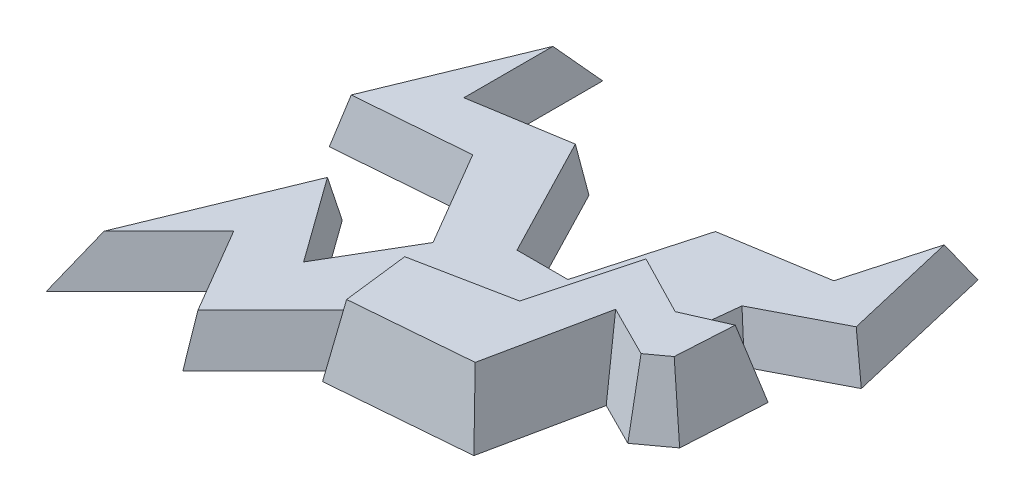
ISO-10303-21;
HEADER;
FILE_DESCRIPTION(('STEP AP214'),'2;1');
FILE_NAME('part.step','',(''),(''),'','','');
FILE_SCHEMA(('AUTOMOTIVE_DESIGN { 1 0 10303 214 1 1 1 1 }'));
ENDSEC;
DATA;
#1=APPLICATION_CONTEXT('core data for automotive mechanical design processes');
#2=APPLICATION_PROTOCOL_DEFINITION('international standard','automotive_design',2000,#1);
#3=PRODUCT_CONTEXT('',#1,'mechanical');
#4=PRODUCT('Part','Part','',(#3));
#5=PRODUCT_RELATED_PRODUCT_CATEGORY('part','',(#4));
#6=PRODUCT_DEFINITION_FORMATION('','',#4);
#7=PRODUCT_DEFINITION_CONTEXT('part definition',#1,'design');
#8=PRODUCT_DEFINITION('design','',#6,#7);
#9=PRODUCT_DEFINITION_SHAPE('','',#8);
#10=(LENGTH_UNIT() NAMED_UNIT(*) SI_UNIT(.MILLI.,.METRE.));
#11=(NAMED_UNIT(*) PLANE_ANGLE_UNIT() SI_UNIT($,.RADIAN.));
#12=(NAMED_UNIT(*) SI_UNIT($,.STERADIAN.) SOLID_ANGLE_UNIT());
#13=UNCERTAINTY_MEASURE_WITH_UNIT(LENGTH_MEASURE(1.E-05),#10,'distance_accuracy_value','');
#14=(GEOMETRIC_REPRESENTATION_CONTEXT(3) GLOBAL_UNCERTAINTY_ASSIGNED_CONTEXT((#13)) GLOBAL_UNIT_ASSIGNED_CONTEXT((#10,
#11,#12)) REPRESENTATION_CONTEXT('',''));
#15=CARTESIAN_POINT('',(0.,0.,0.));
#16=DIRECTION('',(0.,0.,1.));
#17=DIRECTION('',(1.,0.,0.));
#18=AXIS2_PLACEMENT_3D('',#15,#16,#17);
#19=CARTESIAN_POINT('',(-6.84757409622705,0.,-2.71792899711265));
#20=DIRECTION('',(-0.977739651608164,0.173648177666931,0.117777264640086));
#21=DIRECTION('',(-0.17486523314486,-0.984592377706223,0.));
#22=AXIS2_PLACEMENT_3D('',#19,#20,#21);
#23=PLANE('',#22);
#24=DIRECTION('',(0.122145306521807,0.92745628725644,-0.353419523121167));
#25=VECTOR('',#24,1.);
#26=CARTESIAN_POINT('',(-6.34440731271561,0.976717897552328,0.019108864920668));
#27=LINE('',#26,#25);
#28=CARTESIAN_POINT('',(-6.47304033684959,0.,0.391300178214777));
#29=VERTEX_POINT('',#28);
#30=CARTESIAN_POINT('',(-6.20964181726408,2.,-0.370826356431156));
#31=VERTEX_POINT('',#30);
#32=EDGE_CURVE('E352',#29,#31,#27,.T.);
#33=ORIENTED_EDGE('',*,*,#32,.F.);
#34=DIRECTION('',(0.119594168790653,0.,0.992822861738826));
#35=VECTOR('',#34,1.);
#36=CARTESIAN_POINT('',(-6.84757409622705,0.,-2.71792899711265));
#37=LINE('',#36,#35);
#38=CARTESIAN_POINT('',(-6.38636652485047,0.,1.11083143075774));
#39=VERTEX_POINT('',#38);
#40=EDGE_CURVE('E401',#29,#39,#37,.T.);
#41=ORIENTED_EDGE('',*,*,#40,.T.);
#42=DIRECTION('',(-0.150311999552599,-0.971316400591025,0.184257300353054));
#43=VECTOR('',#42,1.);
#44=CARTESIAN_POINT('',(-6.38636652485047,0.,1.11083143075774));
#45=LINE('',#44,#43);
#46=CARTESIAN_POINT('',(-5.92211409548409,3.,0.541735819149813));
#47=VERTEX_POINT('',#46);
#48=EDGE_CURVE('E41',#47,#39,#45,.T.);
#49=ORIENTED_EDGE('',*,*,#48,.F.);
#50=DIRECTION('',(-0.119594168790654,0.,-0.992822861738827));
#51=VECTOR('',#50,1.);
#52=CARTESIAN_POINT('',(-6.32238972346081,3.,-2.78119203319223));
#53=LINE('',#52,#51);
#54=CARTESIAN_POINT('',(-6.26379122764096,3.,-2.29473080434004));
#55=VERTEX_POINT('',#54);
#56=EDGE_CURVE('E415',#55,#47,#53,.F.);
#57=ORIENTED_EDGE('',*,*,#56,.F.);
#58=DIRECTION('',(-0.189206116780364,-0.972310735523728,-0.137160048695684));
#59=VECTOR('',#58,1.);
#60=CARTESIAN_POINT('',(-6.84757409622705,0.,-2.71792899711265));
#61=LINE('',#60,#59);
#62=CARTESIAN_POINT('',(-6.45838551716966,2.,-2.43579686859757));
#63=VERTEX_POINT('',#62);
#64=EDGE_CURVE('E419',#55,#63,#61,.T.);
#65=ORIENTED_EDGE('',*,*,#64,.T.);
#66=DIRECTION('',(-0.119594168790654,0.,-0.992822861738827));
#67=VECTOR('',#66,1.);
#68=CARTESIAN_POINT('',(-6.49745118104956,2.,-2.76010435449904));
#69=LINE('',#68,#67);
#70=EDGE_CURVE('E48',#63,#31,#69,.F.);
#71=ORIENTED_EDGE('',*,*,#70,.T.);
#72=EDGE_LOOP('',(#33,#41,#49,#57,#65,#71));
#73=FACE_BOUND('',#72,.T.);
#74=ADVANCED_FACE('F33',(#73),#23,.T.);
#75=CARTESIAN_POINT('',(3.95018334343433,0.,-7.6734766822284));
#76=DIRECTION('',(-0.395695699109095,0.173648177666931,-0.9018155155571));
#77=DIRECTION('',(-0.915727473508143,0.,0.401799943084109));
#78=AXIS2_PLACEMENT_3D('',#75,#76,#77);
#79=PLANE('',#78);
#80=DIRECTION('',(0.196110610489851,-0.943335432096796,-0.267691783594583));
#81=VECTOR('',#80,1.);
#82=CARTESIAN_POINT('',(2.07084899192303,-0.592330667024033,-6.96292406018774));
#83=LINE('',#82,#81);
#84=CARTESIAN_POINT('',(1.58859320004922,1.72742640615075,-6.30464293632067));
#85=VERTEX_POINT('',#84);
#86=CARTESIAN_POINT('',(1.94770898809242,0.,-6.79483745245693));
#87=VERTEX_POINT('',#86);
#88=EDGE_CURVE('E244',#85,#87,#83,.T.);
#89=ORIENTED_EDGE('',*,*,#88,.F.);
#90=DIRECTION('',(0.00596409304079609,-0.98145497975862,-0.191599979909203));
#91=VECTOR('',#90,1.);
#92=CARTESIAN_POINT('',(1.60035286775977,-0.2077520620373,-6.68242914482995));
#93=LINE('',#92,#91);
#94=CARTESIAN_POINT('',(1.58086004114586,3.,-6.05621068008569));
#95=VERTEX_POINT('',#94);
#96=EDGE_CURVE('E428',#95,#85,#93,.T.);
#97=ORIENTED_EDGE('',*,*,#96,.F.);
#98=DIRECTION('',(0.915727473508143,0.,-0.401799943084109));
#99=VECTOR('',#98,1.);
#100=CARTESIAN_POINT('',(4.16272785587289,3.,-7.18907430056195));
#101=LINE('',#100,#99);
#102=CARTESIAN_POINT('',(3.37208703292243,3.,-6.84215947398757));
#103=VERTEX_POINT('',#102);
#104=EDGE_CURVE('E456',#103,#95,#101,.F.);
#105=ORIENTED_EDGE('',*,*,#104,.F.);
#106=DIRECTION('',(0.182579436844118,-0.947486258902665,-0.262553877199169));
#107=VECTOR('',#106,1.);
#108=CARTESIAN_POINT('',(3.95018334343433,0.,-7.6734766822284));
#109=LINE('',#108,#107);
#110=CARTESIAN_POINT('',(3.95018334343433,0.,-7.6734766822284));
#111=VERTEX_POINT('',#110);
#112=EDGE_CURVE('E430',#103,#111,#109,.T.);
#113=ORIENTED_EDGE('',*,*,#112,.T.);
#114=DIRECTION('',(-0.915727473508143,0.,0.401799943084109));
#115=VECTOR('',#114,1.);
#116=CARTESIAN_POINT('',(3.95018334343433,0.,-7.6734766822284));
#117=LINE('',#116,#115);
#118=EDGE_CURVE('E413',#111,#87,#117,.T.);
#119=ORIENTED_EDGE('',*,*,#118,.T.);
#120=EDGE_LOOP('',(#89,#97,#105,#113,#119));
#121=FACE_BOUND('',#120,.T.);
#122=ADVANCED_FACE('F498',(#121),#79,.T.);
#123=CARTESIAN_POINT('',(1.59909040269213,0.,-6.64187171557096));
#124=DIRECTION('',(0.451018415672112,0.173648177666931,-0.875459136178024));
#125=DIRECTION('',(-0.888964504493672,0.,-0.45797610172401));
#126=AXIS2_PLACEMENT_3D('',#123,#124,#125);
#127=PLANE('',#126);
#128=DIRECTION('',(0.184095479758447,-0.97789730850518,-0.0991247111008756));
#129=VECTOR('',#128,1.);
#130=CARTESIAN_POINT('',(1.90608533699754,0.0409390105846478,-6.47559399059477));
#131=LINE('',#130,#129);
#132=CARTESIAN_POINT('',(1.57059384160355,1.82303725005597,-6.29495132842096));
#133=VERTEX_POINT('',#132);
#134=EDGE_CURVE('E56',#133,#85,#131,.T.);
#135=ORIENTED_EDGE('',*,*,#134,.F.);
#136=DIRECTION('',(0.450935935573091,-0.890821799330091,0.0556174778924801));
#137=VECTOR('',#136,1.);
#138=CARTESIAN_POINT('',(2.300008244792,0.382082560384103,-6.20498690943485));
#139=LINE('',#138,#137);
#140=CARTESIAN_POINT('',(1.48101491204928,2.,-6.30599980280743));
#141=VERTEX_POINT('',#140);
#142=EDGE_CURVE('E394',#141,#133,#139,.T.);
#143=ORIENTED_EDGE('',*,*,#142,.F.);
#144=DIRECTION('',(0.888964504493672,0.,0.45797610172401));
#145=VECTOR('',#144,1.);
#146=CARTESIAN_POINT('',(1.43758331618487,2.,-6.32837486150223));
#147=LINE('',#146,#145);
#148=CARTESIAN_POINT('',(-1.12075471469858,2.,-7.64637763028952));
#149=VERTEX_POINT('',#148);
#150=EDGE_CURVE('E398',#141,#149,#147,.F.);
#151=ORIENTED_EDGE('',*,*,#150,.T.);
#152=DIRECTION('',(-0.109620556370867,-0.962686191268677,-0.247423989866685));
#153=VECTOR('',#152,1.);
#154=CARTESIAN_POINT('',(-1.34849363391254,0.,-8.16040596498624));
#155=LINE('',#154,#153);
#156=CARTESIAN_POINT('',(-1.0068852550916,3.,-7.38936346294115));
#157=VERTEX_POINT('',#156);
#158=EDGE_CURVE('E425',#157,#149,#155,.T.);
#159=ORIENTED_EDGE('',*,*,#158,.F.);
#160=DIRECTION('',(0.888964504493672,0.,0.45797610172401));
#161=VECTOR('',#160,1.);
#162=CARTESIAN_POINT('',(1.35682977293124,3.,-6.17162643446786));
#163=LINE('',#162,#161);
#164=EDGE_CURVE('E458',#95,#157,#163,.F.);
#165=ORIENTED_EDGE('',*,*,#164,.F.);
#166=ORIENTED_EDGE('',*,*,#96,.T.);
#167=EDGE_LOOP('',(#135,#143,#151,#159,#165,#166));
#168=FACE_BOUND('',#167,.T.);
#169=ADVANCED_FACE('F501',(#168),#127,.T.);
#170=CARTESIAN_POINT('',(-6.38636652485047,0.,1.11083143075774));
#171=DIRECTION('',(0.0810036292405644,0.173648177666931,0.981470693624018));
#172=DIRECTION('',(0.,-0.984706630160281,0.174220700602377));
#173=AXIS2_PLACEMENT_3D('',#170,#171,#172);
#174=PLANE('',#173);
#175=DIRECTION('',(0.996611461091789,0.,-0.0822532407901954));
#176=VECTOR('',#175,1.);
#177=CARTESIAN_POINT('',(-6.38636652485047,0.,1.11083143075774));
#178=LINE('',#177,#176);
#179=CARTESIAN_POINT('',(-0.387798033415265,0.,0.615752136784966));
#180=VERTEX_POINT('',#179);
#181=EDGE_CURVE('E403',#39,#180,#178,.T.);
#182=ORIENTED_EDGE('',*,*,#181,.T.);
#183=DIRECTION('',(0.142358780321208,-0.976626593005354,0.161041843941918));
#184=VECTOR('',#183,1.);
#185=CARTESIAN_POINT('',(-0.387798033415265,0.,0.615752136784966));
#186=LINE('',#185,#184);
#187=CARTESIAN_POINT('',(-0.825095506187732,3.,0.121064059186096));
#188=VERTEX_POINT('',#187);
#189=EDGE_CURVE('E418',#188,#180,#186,.T.);
#190=ORIENTED_EDGE('',*,*,#189,.F.);
#191=DIRECTION('',(-0.996611461091789,0.,0.0822532407901954));
#192=VECTOR('',#191,1.);
#193=CARTESIAN_POINT('',(-6.42987692165654,3.,0.58364296113644));
#194=LINE('',#193,#192);
#195=EDGE_CURVE('E446',#47,#188,#194,.F.);
#196=ORIENTED_EDGE('',*,*,#195,.F.);
#197=ORIENTED_EDGE('',*,*,#48,.T.);
#198=EDGE_LOOP('',(#182,#190,#196,#197));
#199=FACE_BOUND('',#198,.T.);
#200=ADVANCED_FACE('F35',(#199),#174,.T.);
#201=CARTESIAN_POINT('',(-0.387798033415265,0.,0.615752136784966));
#202=DIRECTION('',(0.964116890076162,0.173648177666931,0.200810688616974));
#203=DIRECTION('',(0.203908517172778,0.,-0.978989947151859));
#204=AXIS2_PLACEMENT_3D('',#201,#202,#203);
#205=PLANE('',#204);
#206=DIRECTION('',(0.203908517172778,0.,-0.978989947151859));
#207=VECTOR('',#206,1.);
#208=CARTESIAN_POINT('',(-0.387798033415265,0.,0.615752136784966));
#209=LINE('',#208,#207);
#210=CARTESIAN_POINT('',(0.591376610391086,0.,-4.08538612896079));
#211=VERTEX_POINT('',#210);
#212=EDGE_CURVE('E405',#180,#211,#209,.T.);
#213=ORIENTED_EDGE('',*,*,#212,.T.);
#214=DIRECTION('',(0.120856457531196,-0.960571112235542,0.250393400495267));
#215=VECTOR('',#214,1.);
#216=CARTESIAN_POINT('',(0.719338752980646,-1.01704733153848,-3.82027099426151));
#217=LINE('',#216,#215);
#218=CARTESIAN_POINT('',(0.213924729967806,3.,-4.86740027858223));
#219=VERTEX_POINT('',#218);
#220=EDGE_CURVE('E439',#219,#211,#217,.T.);
#221=ORIENTED_EDGE('',*,*,#220,.F.);
#222=DIRECTION('',(-0.203908517172778,0.,0.978989947151859));
#223=VECTOR('',#222,1.);
#224=CARTESIAN_POINT('',(-0.905665057990947,3.,0.507888417263518));
#225=LINE('',#224,#223);
#226=EDGE_CURVE('E448',#188,#219,#225,.F.);
#227=ORIENTED_EDGE('',*,*,#226,.F.);
#228=ORIENTED_EDGE('',*,*,#189,.T.);
#229=EDGE_LOOP('',(#213,#221,#227,#228));
#230=FACE_BOUND('',#229,.T.);
#231=ADVANCED_FACE('F480',(#230),#205,.T.);
#232=CARTESIAN_POINT('',(0.591376610391086,0.,-4.08538612896079));
#233=DIRECTION('',(-0.442559045273277,0.173648177666931,0.879765765326066));
#234=DIRECTION('',(0.893337570338117,0.,0.449386231901234));
#235=AXIS2_PLACEMENT_3D('',#232,#233,#234);
#236=PLANE('',#235);
#237=DIRECTION('',(0.893337570338117,0.,0.449386231901234));
#238=VECTOR('',#237,1.);
#239=CARTESIAN_POINT('',(0.591376610391086,0.,-4.08538612896079));
#240=LINE('',#239,#238);
#241=CARTESIAN_POINT('',(2.45789253246187,0.,-3.14645040650419));
#242=VERTEX_POINT('',#241);
#243=EDGE_CURVE('E407',#211,#242,#240,.T.);
#244=ORIENTED_EDGE('',*,*,#243,.T.);
#245=DIRECTION('',(0.0167052120660392,-0.979305149909187,0.201698684306996));
#246=VECTOR('',#245,1.);
#247=CARTESIAN_POINT('',(2.45789253246187,0.,-3.14645040650419));
#248=LINE('',#247,#246);
#249=CARTESIAN_POINT('',(2.40671784375247,3.,-3.76433345651888));
#250=VERTEX_POINT('',#249);
#251=EDGE_CURVE('E436',#250,#242,#248,.T.);
#252=ORIENTED_EDGE('',*,*,#251,.F.);
#253=DIRECTION('',(-0.893337570338117,0.,-0.449386231901234));
#254=VECTOR('',#253,1.);
#255=CARTESIAN_POINT('',(0.829093362720382,3.,-4.55794467855426));
#256=LINE('',#255,#254);
#257=EDGE_CURVE('E450',#219,#250,#256,.F.);
#258=ORIENTED_EDGE('',*,*,#257,.F.);
#259=ORIENTED_EDGE('',*,*,#220,.T.);
#260=EDGE_LOOP('',(#244,#252,#258,#259));
#261=FACE_BOUND('',#260,.T.);
#262=ADVANCED_FACE('F484',(#261),#236,.T.);
#263=CARTESIAN_POINT('',(2.45789253246187,0.,-3.14645040650419));
#264=DIRECTION('',(0.581265035705157,0.173648177666931,0.794969979722277));
#265=DIRECTION('',(0.807233673060271,0.,-0.590231985813734));
#266=AXIS2_PLACEMENT_3D('',#263,#264,#265);
#267=PLANE('',#266);
#268=DIRECTION('',(0.807233673060271,0.,-0.590231985813734));
#269=VECTOR('',#268,1.);
#270=CARTESIAN_POINT('',(2.45789253246187,0.,-3.14645040650419));
#271=LINE('',#270,#269);
#272=CARTESIAN_POINT('',(3.74203258285442,0.,-4.08538612896079));
#273=VERTEX_POINT('',#272);
#274=EDGE_CURVE('E409',#242,#273,#271,.T.);
#275=ORIENTED_EDGE('',*,*,#274,.T.);
#276=DIRECTION('',(0.168050186219375,-0.981520647779553,0.0915224174398881));
#277=VECTOR('',#276,1.);
#278=CARTESIAN_POINT('',(3.74203258285442,0.,-4.08538612896079));
#279=LINE('',#278,#277);
#280=CARTESIAN_POINT('',(3.22839024654836,3.,-4.36512273250632));
#281=VERTEX_POINT('',#280);
#282=EDGE_CURVE('E433',#281,#273,#279,.T.);
#283=ORIENTED_EDGE('',*,*,#282,.F.);
#284=DIRECTION('',(-0.807233673060271,0.,0.590231985813734));
#285=VECTOR('',#284,1.);
#286=CARTESIAN_POINT('',(2.14567106053358,3.,-3.57346163539495));
#287=LINE('',#286,#285);
#288=EDGE_CURVE('E452',#250,#281,#287,.F.);
#289=ORIENTED_EDGE('',*,*,#288,.F.);
#290=ORIENTED_EDGE('',*,*,#251,.T.);
#291=EDGE_LOOP('',(#275,#283,#289,#290));
#292=FACE_BOUND('',#291,.T.);
#293=ADVANCED_FACE('F489',(#292),#267,.T.);
#294=CARTESIAN_POINT('',(3.74203258285442,0.,-4.08538612896079));
#295=DIRECTION('',(0.983154816386481,0.173648177666931,0.0570343528850703));
#296=DIRECTION('',(-0.173931300175167,0.984757788910235,0.));
#297=AXIS2_PLACEMENT_3D('',#294,#295,#296);
#298=PLANE('',#297);
#299=DIRECTION('',(0.0579141997111829,0.,-0.998321564162476));
#300=VECTOR('',#299,1.);
#301=CARTESIAN_POINT('',(3.74203258285442,0.,-4.08538612896079));
#302=LINE('',#301,#300);
#303=EDGE_CURVE('E411',#273,#111,#302,.T.);
#304=ORIENTED_EDGE('',*,*,#303,.T.);
#305=ORIENTED_EDGE('',*,*,#112,.F.);
#306=DIRECTION('',(-0.0579141997111828,0.,0.998321564162476));
#307=VECTOR('',#306,1.);
#308=CARTESIAN_POINT('',(3.21393950129965,3.,-4.11602163688645));
#309=LINE('',#308,#307);
#310=EDGE_CURVE('E454',#281,#103,#309,.F.);
#311=ORIENTED_EDGE('',*,*,#310,.F.);
#312=ORIENTED_EDGE('',*,*,#282,.T.);
#313=EDGE_LOOP('',(#304,#305,#311,#312));
#314=FACE_BOUND('',#313,.T.);
#315=ADVANCED_FACE('F495',(#314),#298,.T.);
#316=CARTESIAN_POINT('',(-1.34849363391254,0.,-8.16040596498624));
#317=DIRECTION('',(-0.951463608684397,0.173648177666931,-0.25409311628263));
#318=DIRECTION('',(-0.258012912170362,0.,0.966141468498982));
#319=AXIS2_PLACEMENT_3D('',#316,#317,#318);
#320=PLANE('',#319);
#321=ORIENTED_EDGE('',*,*,#158,.T.);
#322=DIRECTION('',(0.258012912170362,0.,-0.966141468498982));
#323=VECTOR('',#322,1.);
#324=CARTESIAN_POINT('',(-1.0077800177572,2.,-8.06941668941264));
#325=LINE('',#324,#323);
#326=CARTESIAN_POINT('',(-2.290826725436,2.,-3.26498802775292));
#327=VERTEX_POINT('',#326);
#328=EDGE_CURVE('E396',#149,#327,#325,.F.);
#329=ORIENTED_EDGE('',*,*,#328,.T.);
#330=DIRECTION('',(-0.139073846981094,-0.979106170351458,-0.148356234333382));
#331=VECTOR('',#330,1.);
#332=CARTESIAN_POINT('',(-2.6459412551288,-0.500073412443538,-3.64380443016001));
#333=LINE('',#332,#331);
#334=CARTESIAN_POINT('',(-2.14878508460846,3.,-3.11346591623346));
#335=VERTEX_POINT('',#334);
#336=EDGE_CURVE('E421',#335,#327,#333,.T.);
#337=ORIENTED_EDGE('',*,*,#336,.F.);
#338=DIRECTION('',(0.258012912170362,0.,-0.966141468498982));
#339=VECTOR('',#338,1.);
#340=CARTESIAN_POINT('',(-0.837423209679535,3.,-8.02392205162584));
#341=LINE('',#340,#339);
#342=EDGE_CURVE('E460',#157,#335,#341,.F.);
#343=ORIENTED_EDGE('',*,*,#342,.F.);
#344=EDGE_LOOP('',(#321,#329,#337,#343));
#345=FACE_BOUND('',#344,.T.);
#346=ADVANCED_FACE('F505',(#345),#320,.T.);
#347=CARTESIAN_POINT('',(-2.57491000709109,0.,-3.56803225079183));
#348=DIRECTION('',(-0.192173763358184,0.173648177666931,-0.965875538084337));
#349=DIRECTION('',(-0.980775725140299,0.,0.195138353420133));
#350=AXIS2_PLACEMENT_3D('',#347,#348,#349);
#351=PLANE('',#350);
#352=ORIENTED_EDGE('',*,*,#336,.T.);
#353=DIRECTION('',(0.980775725140299,0.,-0.195138353420133));
#354=VECTOR('',#353,1.);
#355=CARTESIAN_POINT('',(-2.5060936937331,2.,-3.22215780605954));
#356=LINE('',#355,#354);
#357=EDGE_CURVE('E11',#327,#63,#356,.F.);
#358=ORIENTED_EDGE('',*,*,#357,.T.);
#359=ORIENTED_EDGE('',*,*,#64,.F.);
#360=DIRECTION('',(0.980775725140299,0.,-0.195138353420133));
#361=VECTOR('',#360,1.);
#362=CARTESIAN_POINT('',(-2.47168553705411,3.,-3.0492205836934));
#363=LINE('',#362,#361);
#364=EDGE_CURVE('E422',#335,#55,#363,.F.);
#365=ORIENTED_EDGE('',*,*,#364,.F.);
#366=EDGE_LOOP('',(#352,#358,#359,#365));
#367=FACE_BOUND('',#366,.T.);
#368=ADVANCED_FACE('F470',(#367),#351,.T.);
#369=CARTESIAN_POINT('',(0.,3.,0.));
#370=DIRECTION('',(0.,1.,0.));
#371=DIRECTION('',(0.,0.,1.));
#372=AXIS2_PLACEMENT_3D('',#369,#370,#371);
#373=PLANE('',#372);
#374=ORIENTED_EDGE('',*,*,#56,.T.);
#375=ORIENTED_EDGE('',*,*,#195,.T.);
#376=ORIENTED_EDGE('',*,*,#226,.T.);
#377=ORIENTED_EDGE('',*,*,#257,.T.);
#378=ORIENTED_EDGE('',*,*,#288,.T.);
#379=ORIENTED_EDGE('',*,*,#310,.T.);
#380=ORIENTED_EDGE('',*,*,#104,.T.);
#381=ORIENTED_EDGE('',*,*,#164,.T.);
#382=ORIENTED_EDGE('',*,*,#342,.T.);
#383=ORIENTED_EDGE('',*,*,#364,.T.);
#384=EDGE_LOOP('',(#374,#375,#376,#377,#378,#379,#380,#381,#382,#383));
#385=FACE_BOUND('',#384,.T.);
#386=ADVANCED_FACE('F464',(#385),#373,.T.);
#387=CARTESIAN_POINT('',(0.,0.,0.));
#388=DIRECTION('',(0.,1.,0.));
#389=DIRECTION('',(0.,0.,1.));
#390=AXIS2_PLACEMENT_3D('',#387,#388,#389);
#391=PLANE('',#390);
#392=ORIENTED_EDGE('',*,*,#40,.F.);
#393=DIRECTION('',(0.707106781186541,0.,-0.707106781186554));
#394=VECTOR('',#393,1.);
#395=CARTESIAN_POINT('',(-5.40108762142211,0.,-0.680652537212723));
#396=LINE('',#395,#394);
#397=CARTESIAN_POINT('',(-9.78574087941727,0.,3.70400072078251));
#398=VERTEX_POINT('',#397);
#399=EDGE_CURVE('E296',#398,#29,#396,.T.);
#400=ORIENTED_EDGE('',*,*,#399,.F.);
#401=DIRECTION('',(0.505550363285331,0.,0.862797096762657));
#402=VECTOR('',#401,1.);
#403=CARTESIAN_POINT('',(-9.78574087941727,0.,3.70400072078251));
#404=LINE('',#403,#402);
#405=CARTESIAN_POINT('',(-11.956076079926,0.,0.));
#406=VERTEX_POINT('',#405);
#407=EDGE_CURVE('E294',#406,#398,#404,.T.);
#408=ORIENTED_EDGE('',*,*,#407,.F.);
#409=DIRECTION('',(0.707106781186541,0.,-0.707106781186554));
#410=VECTOR('',#409,1.);
#411=CARTESIAN_POINT('',(-11.956076079926,0.,0.));
#412=LINE('',#411,#410);
#413=CARTESIAN_POINT('',(-15.6600768007084,0.,3.70400072078251));
#414=VERTEX_POINT('',#413);
#415=EDGE_CURVE('E292',#414,#406,#412,.T.);
#416=ORIENTED_EDGE('',*,*,#415,.F.);
#417=DIRECTION('',(-0.380250240644345,0.,0.924883643757374));
#418=VECTOR('',#417,1.);
#419=CARTESIAN_POINT('',(-15.6600768007084,0.,3.70400072078251));
#420=LINE('',#419,#418);
#421=CARTESIAN_POINT('',(-11.956076079926,0.,-5.30524981200386));
#422=VERTEX_POINT('',#421);
#423=EDGE_CURVE('E290',#422,#414,#420,.T.);
#424=ORIENTED_EDGE('',*,*,#423,.F.);
#425=DIRECTION('',(-0.58457001511121,0.,-0.811343267324552));
#426=VECTOR('',#425,1.);
#427=CARTESIAN_POINT('',(-11.956076079926,0.,-5.30524981200386));
#428=LINE('',#427,#426);
#429=CARTESIAN_POINT('',(-9.26834297739492,0.,-1.57485978047093));
#430=VERTEX_POINT('',#429);
#431=EDGE_CURVE('E288',#430,#422,#428,.T.);
#432=ORIENTED_EDGE('',*,*,#431,.F.);
#433=DIRECTION('',(-0.506079371918981,0.,0.862486909650279));
#434=VECTOR('',#433,1.);
#435=CARTESIAN_POINT('',(-9.26834297739492,0.,-1.57485978047093));
#436=LINE('',#435,#434);
#437=CARTESIAN_POINT('',(-7.59341425041969,0.,-4.42936083657131));
#438=VERTEX_POINT('',#437);
#439=EDGE_CURVE('E286',#438,#430,#436,.T.);
#440=ORIENTED_EDGE('',*,*,#439,.F.);
#441=DIRECTION('',(0.505550363285331,0.,0.862797096762657));
#442=VECTOR('',#441,1.);
#443=CARTESIAN_POINT('',(-7.59341425041969,0.,-4.42936083657131));
#444=LINE('',#443,#442);
#445=CARTESIAN_POINT('',(-9.78574087941727,0.,-8.17089321004721));
#446=VERTEX_POINT('',#445);
#447=EDGE_CURVE('E284',#446,#438,#444,.T.);
#448=ORIENTED_EDGE('',*,*,#447,.F.);
#449=DIRECTION('',(0.996896614776686,0.,-0.0787219121133614));
#450=VECTOR('',#449,1.);
#451=CARTESIAN_POINT('',(-9.78574087941727,0.,-8.17089321004721));
#452=LINE('',#451,#450);
#453=CARTESIAN_POINT('',(-14.9679567921766,0.,-7.76166928492827));
#454=VERTEX_POINT('',#453);
#455=EDGE_CURVE('E282',#454,#446,#452,.T.);
#456=ORIENTED_EDGE('',*,*,#455,.F.);
#457=DIRECTION('',(-0.380250240644345,0.,0.924883643757375));
#458=VECTOR('',#457,1.);
#459=CARTESIAN_POINT('',(-14.9679567921766,0.,-7.76166928492827));
#460=LINE('',#459,#458);
#461=CARTESIAN_POINT('',(-11.5497747247508,0.,-16.0757223679448));
#462=VERTEX_POINT('',#461);
#463=EDGE_CURVE('E280',#462,#454,#460,.T.);
#464=ORIENTED_EDGE('',*,*,#463,.F.);
#465=DIRECTION('',(0.,0.,-1.));
#466=VECTOR('',#465,1.);
#467=CARTESIAN_POINT('',(-11.5497747247508,0.,-16.0757223679448));
#468=LINE('',#467,#466);
#469=CARTESIAN_POINT('',(-11.5497747247508,0.,-10.8860441730592));
#470=VERTEX_POINT('',#469);
#471=EDGE_CURVE('E278',#470,#462,#468,.T.);
#472=ORIENTED_EDGE('',*,*,#471,.F.);
#473=DIRECTION('',(-0.987015011420159,0.,0.160628039990732));
#474=VECTOR('',#473,1.);
#475=CARTESIAN_POINT('',(-11.5497747247508,0.,-10.8860441730592));
#476=LINE('',#475,#474);
#477=CARTESIAN_POINT('',(-7.59341425041969,0.,-11.5299071550155));
#478=VERTEX_POINT('',#477);
#479=EDGE_CURVE('E276',#478,#470,#476,.T.);
#480=ORIENTED_EDGE('',*,*,#479,.F.);
#481=DIRECTION('',(-0.459872295328065,0.,-0.887985062931633));
#482=VECTOR('',#481,1.);
#483=CARTESIAN_POINT('',(-7.59341425041969,0.,-11.5299071550155));
#484=LINE('',#483,#482);
#485=CARTESIAN_POINT('',(-4.88500045651108,0.,-6.30012702330926));
#486=VERTEX_POINT('',#485);
#487=EDGE_CURVE('E274',#486,#478,#484,.T.);
#488=ORIENTED_EDGE('',*,*,#487,.F.);
#489=DIRECTION('',(-1.,0.,0.));
#490=VECTOR('',#489,1.);
#491=CARTESIAN_POINT('',(-4.88500045651108,0.,-6.30012702330926));
#492=LINE('',#491,#490);
#493=CARTESIAN_POINT('',(-3.1839482956002,0.,-6.30012702330926));
#494=VERTEX_POINT('',#493);
#495=EDGE_CURVE('E272',#494,#486,#492,.T.);
#496=ORIENTED_EDGE('',*,*,#495,.F.);
#497=DIRECTION('',(-0.269285094003856,0.,0.963060505963844));
#498=VECTOR('',#497,1.);
#499=CARTESIAN_POINT('',(-3.1839482956002,0.,-6.30012702330926));
#500=LINE('',#499,#498);
#501=CARTESIAN_POINT('',(-1.81164564754128,0.,-11.2079756640373));
#502=VERTEX_POINT('',#501);
#503=EDGE_CURVE('E270',#502,#494,#500,.T.);
#504=ORIENTED_EDGE('',*,*,#503,.F.);
#505=DIRECTION('',(-0.987015011420159,0.,0.160628039990732));
#506=VECTOR('',#505,1.);
#507=CARTESIAN_POINT('',(-1.81164564754128,0.,-11.2079756640373));
#508=LINE('',#507,#506);
#509=CARTESIAN_POINT('',(2.55553376426917,0.,-11.9186958264365));
#510=VERTEX_POINT('',#509);
#511=EDGE_CURVE('E268',#510,#502,#508,.T.);
#512=ORIENTED_EDGE('',*,*,#511,.F.);
#513=DIRECTION('',(-0.269285094003856,0.,0.963060505963844));
#514=VECTOR('',#513,1.);
#515=CARTESIAN_POINT('',(2.55553376426917,0.,-11.9186958264365));
#516=LINE('',#515,#514);
#517=CARTESIAN_POINT('',(3.90087759887158,0.,-16.7301300383464));
#518=VERTEX_POINT('',#517);
#519=EDGE_CURVE('E264',#518,#510,#516,.T.);
#520=ORIENTED_EDGE('',*,*,#519,.F.);
#521=DIRECTION('',(-0.228251078526055,0.,-0.973602303382491));
#522=VECTOR('',#521,1.);
#523=CARTESIAN_POINT('',(3.90087759887158,0.,-16.7301300383464));
#524=LINE('',#523,#522);
#525=CARTESIAN_POINT('',(5.434208615999,0.,-10.1897245350591));
#526=VERTEX_POINT('',#525);
#527=EDGE_CURVE('E262',#526,#518,#524,.T.);
#528=ORIENTED_EDGE('',*,*,#527,.F.);
#529=DIRECTION('',(0.887985062931633,0.,-0.459872295328065));
#530=VECTOR('',#529,1.);
#531=CARTESIAN_POINT('',(5.434208615999,0.,-10.1897245350591));
#532=LINE('',#531,#530);
#533=CARTESIAN_POINT('',(2.12887895922522,0.,-8.47795076821422));
#534=VERTEX_POINT('',#533);
#535=EDGE_CURVE('E248',#534,#526,#532,.T.);
#536=ORIENTED_EDGE('',*,*,#535,.F.);
#537=DIRECTION('',(0.107021586398645,0.,-0.994256697259172));
#538=VECTOR('',#537,1.);
#539=CARTESIAN_POINT('',(2.12887895922522,0.,-8.47795076821422));
#540=LINE('',#539,#538);
#541=EDGE_CURVE('E238',#87,#534,#540,.T.);
#542=ORIENTED_EDGE('',*,*,#541,.F.);
#543=ORIENTED_EDGE('',*,*,#118,.F.);
#544=ORIENTED_EDGE('',*,*,#303,.F.);
#545=ORIENTED_EDGE('',*,*,#274,.F.);
#546=ORIENTED_EDGE('',*,*,#243,.F.);
#547=ORIENTED_EDGE('',*,*,#212,.F.);
#548=ORIENTED_EDGE('',*,*,#181,.F.);
#549=EDGE_LOOP('',(#392,#400,#408,#416,#424,#432,#440,#448,#456,#464,#472,#480,#488,#496,#504,
#512,#520,#528,#536,#542,#543,#544,#545,#546,#547,#548));
#550=FACE_BOUND('',#549,.T.);
#551=ADVANCED_FACE('F260',(#550),#391,.F.);
#552=CARTESIAN_POINT('',(0.,2.,0.));
#553=DIRECTION('',(0.,1.,0.));
#554=DIRECTION('',(0.,0.,1.));
#555=AXIS2_PLACEMENT_3D('',#552,#553,#554);
#556=PLANE('',#555);
#557=ORIENTED_EDGE('',*,*,#70,.F.);
#558=ORIENTED_EDGE('',*,*,#357,.F.);
#559=ORIENTED_EDGE('',*,*,#328,.F.);
#560=ORIENTED_EDGE('',*,*,#150,.F.);
#561=DIRECTION('',(-0.973602303382491,0.,0.228251078526055));
#562=VECTOR('',#561,1.);
#563=CARTESIAN_POINT('',(1.78531851869812,2.,-6.37734066362468));
#564=LINE('',#563,#562);
#565=CARTESIAN_POINT('',(1.54193691401137,2.,-6.32028234158687));
#566=VERTEX_POINT('',#565);
#567=EDGE_CURVE('E299',#141,#566,#564,.F.);
#568=ORIENTED_EDGE('',*,*,#567,.T.);
#569=DIRECTION('',(-0.107021586398645,0.,0.994256697259172));
#570=VECTOR('',#569,1.);
#571=CARTESIAN_POINT('',(1.77825039627145,2.,-8.51569235461482));
#572=LINE('',#571,#570);
#573=CARTESIAN_POINT('',(1.79852012521266,2.,-8.70400309107083));
#574=VERTEX_POINT('',#573);
#575=EDGE_CURVE('E354',#566,#574,#572,.F.);
#576=ORIENTED_EDGE('',*,*,#575,.T.);
#577=DIRECTION('',(-0.887985062931633,0.,0.459872295328065));
#578=VECTOR('',#577,1.);
#579=CARTESIAN_POINT('',(5.27203282930566,2.,-10.502875985181));
#580=LINE('',#579,#578);
#581=CARTESIAN_POINT('',(5.02818409512482,2.,-10.3765908912287));
#582=VERTEX_POINT('',#581);
#583=EDGE_CURVE('E254',#574,#582,#580,.F.);
#584=ORIENTED_EDGE('',*,*,#583,.T.);
#585=DIRECTION('',(0.228251078526055,0.,0.973602303382491));
#586=VECTOR('',#585,1.);
#587=CARTESIAN_POINT('',(3.55753288973909,2.,-16.6496363913065));
#588=LINE('',#587,#586);
#589=CARTESIAN_POINT('',(3.87085493789923,2.,-15.3131648628515));
#590=VERTEX_POINT('',#589);
#591=EDGE_CURVE('E357',#582,#590,#588,.F.);
#592=ORIENTED_EDGE('',*,*,#591,.T.);
#593=DIRECTION('',(0.269285094003856,0.,-0.963060505963844));
#594=VECTOR('',#593,1.);
#595=CARTESIAN_POINT('',(2.89516086678151,2.,-11.8237313712855));
#596=LINE('',#595,#594);
#597=CARTESIAN_POINT('',(2.83450453029185,2.,-11.6068024605868));
#598=VERTEX_POINT('',#597);
#599=EDGE_CURVE('E359',#590,#598,#596,.F.);
#600=ORIENTED_EDGE('',*,*,#599,.T.);
#601=DIRECTION('',(0.987015011420159,0.,-0.160628039990732));
#602=VECTOR('',#601,1.);
#603=CARTESIAN_POINT('',(-1.75499953292391,2.,-10.859900910282));
#604=LINE('',#603,#602);
#605=CARTESIAN_POINT('',(-1.53267488151861,2.,-10.8960822981876));
#606=VERTEX_POINT('',#605);
#607=EDGE_CURVE('E361',#598,#606,#604,.F.);
#608=ORIENTED_EDGE('',*,*,#607,.T.);
#609=DIRECTION('',(0.269285094003856,0.,-0.963060505963844));
#610=VECTOR('',#609,1.);
#611=CARTESIAN_POINT('',(-2.84432119308786,2.,-6.20516256815827));
#612=LINE('',#611,#610);
#613=CARTESIAN_POINT('',(-2.91637475824697,2.,-5.94747306189233));
#614=VERTEX_POINT('',#613);
#615=EDGE_CURVE('E363',#606,#614,#612,.F.);
#616=ORIENTED_EDGE('',*,*,#615,.T.);
#617=DIRECTION('',(1.,0.,0.));
#618=VECTOR('',#617,1.);
#619=CARTESIAN_POINT('',(-4.88500045651108,2.,-5.94747306189233));
#620=LINE('',#619,#618);
#621=CARTESIAN_POINT('',(-5.09950651373544,2.,-5.94747306189233));
#622=VERTEX_POINT('',#621);
#623=EDGE_CURVE('E365',#614,#622,#620,.F.);
#624=ORIENTED_EDGE('',*,*,#623,.T.);
#625=DIRECTION('',(0.459872295328065,0.,0.887985062931633));
#626=VECTOR('',#625,1.);
#627=CARTESIAN_POINT('',(-7.90656570054159,2.,-11.3677313683221));
#628=LINE('',#627,#626);
#629=CARTESIAN_POINT('',(-7.78903086966,2.,-11.1407788529013));
#630=VERTEX_POINT('',#629);
#631=EDGE_CURVE('E367',#622,#630,#628,.F.);
#632=ORIENTED_EDGE('',*,*,#631,.T.);
#633=DIRECTION('',(0.987015011420159,0.,-0.160628039990732));
#634=VECTOR('',#633,1.);
#635=CARTESIAN_POINT('',(-11.4931286101334,2.,-10.5379694193039));
#636=LINE('',#635,#634);
#637=CARTESIAN_POINT('',(-11.9024286861677,2.,-10.4713594202453));
#638=VERTEX_POINT('',#637);
#639=EDGE_CURVE('E369',#630,#638,#636,.F.);
#640=ORIENTED_EDGE('',*,*,#639,.T.);
#641=DIRECTION('',(0.,0.,1.));
#642=VECTOR('',#641,1.);
#643=CARTESIAN_POINT('',(-11.9024286861677,2.,-16.0757223679448));
#644=LINE('',#643,#642);
#645=CARTESIAN_POINT('',(-11.9024286861677,2.,-14.2905352209559));
#646=VERTEX_POINT('',#645);
#647=EDGE_CURVE('E371',#638,#646,#644,.F.);
#648=ORIENTED_EDGE('',*,*,#647,.T.);
#649=DIRECTION('',(0.380250240644345,0.,-0.924883643757375));
#650=VECTOR('',#649,1.);
#651=CARTESIAN_POINT('',(-14.6417929113558,2.,-7.62757253123531));
#652=LINE('',#651,#650);
#653=CARTESIAN_POINT('',(-14.4235474911669,2.,-8.15841143120721));
#654=VERTEX_POINT('',#653);
#655=EDGE_CURVE('E373',#646,#654,#652,.F.);
#656=ORIENTED_EDGE('',*,*,#655,.T.);
#657=DIRECTION('',(-0.996896614776686,0.,0.0787219121133614));
#658=VECTOR('',#657,1.);
#659=CARTESIAN_POINT('',(-9.81350247357436,2.,-8.52245275037134));
#660=LINE('',#659,#658);
#661=CARTESIAN_POINT('',(-9.59319520496523,2.,-8.53984974939844));
#662=VERTEX_POINT('',#661);
#663=EDGE_CURVE('E375',#654,#662,#660,.F.);
#664=ORIENTED_EDGE('',*,*,#663,.T.);
#665=DIRECTION('',(-0.505550363285331,0.,-0.862797096762657));
#666=VECTOR('',#665,1.);
#667=CARTESIAN_POINT('',(-7.28914543634731,2.,-4.60764517487965));
#668=LINE('',#667,#666);
#669=CARTESIAN_POINT('',(-7.18460743722163,2.,-4.42923548774011));
#670=VERTEX_POINT('',#669);
#671=EDGE_CURVE('E377',#662,#670,#668,.F.);
#672=ORIENTED_EDGE('',*,*,#671,.T.);
#673=DIRECTION('',(0.506079371918982,0.,-0.86248690965028));
#674=VECTOR('',#673,1.);
#675=CARTESIAN_POINT('',(-8.9641835520365,2.,-1.39638888517231));
#676=LINE('',#675,#674);
#677=CARTESIAN_POINT('',(-9.23808456350269,2.,-0.929592469357565));
#678=VERTEX_POINT('',#677);
#679=EDGE_CURVE('E379',#670,#678,#676,.F.);
#680=ORIENTED_EDGE('',*,*,#679,.T.);
#681=DIRECTION('',(0.58457001511121,0.,0.811343267324552));
#682=VECTOR('',#681,1.);
#683=CARTESIAN_POINT('',(-12.242199497217,2.,-5.09909888044934));
#684=LINE('',#683,#682);
#685=CARTESIAN_POINT('',(-11.8712238745822,2.,-4.5842100459459));
#686=VERTEX_POINT('',#685);
#687=EDGE_CURVE('E381',#678,#686,#684,.F.);
#688=ORIENTED_EDGE('',*,*,#687,.T.);
#689=DIRECTION('',(0.380250240644345,0.,-0.924883643757375));
#690=VECTOR('',#689,1.);
#691=CARTESIAN_POINT('',(-15.3339129198877,2.,3.83809747447548));
#692=LINE('',#691,#690);
#693=CARTESIAN_POINT('',(-14.6643695854329,2.,2.20956549044648));
#694=VERTEX_POINT('',#693);
#695=EDGE_CURVE('E383',#686,#694,#692,.F.);
#696=ORIENTED_EDGE('',*,*,#695,.T.);
#697=DIRECTION('',(-0.707106781186541,0.,0.707106781186554));
#698=VECTOR('',#697,1.);
#699=CARTESIAN_POINT('',(-12.2054400874562,2.,-0.249364007530209));
#700=LINE('',#699,#698);
#701=CARTESIAN_POINT('',(-11.8826138671785,2.,-0.572190227807937));
#702=VERTEX_POINT('',#701);
#703=EDGE_CURVE('E385',#694,#702,#700,.F.);
#704=ORIENTED_EDGE('',*,*,#703,.T.);
#705=DIRECTION('',(-0.505550363285331,0.,-0.862797096762657));
#706=VECTOR('',#705,1.);
#707=CARTESIAN_POINT('',(-9.48147206534489,2.,3.52571638247417));
#708=LINE('',#707,#706);
#709=CARTESIAN_POINT('',(-9.71227866666976,2.,3.13181049297458));
#710=VERTEX_POINT('',#709);
#711=EDGE_CURVE('E387',#702,#710,#708,.F.);
#712=ORIENTED_EDGE('',*,*,#711,.T.);
#713=DIRECTION('',(-0.707106781186542,0.,0.707106781186554));
#714=VECTOR('',#713,1.);
#715=CARTESIAN_POINT('',(-5.65045162895232,2.,-0.930016544742931));
#716=LINE('',#715,#714);
#717=EDGE_CURVE('E304',#710,#31,#716,.F.);
#718=ORIENTED_EDGE('',*,*,#717,.T.);
#719=EDGE_LOOP('',(#557,#558,#559,#560,#568,#576,#584,#592,#600,#608,#616,#624,#632,#640,#648,
#656,#664,#672,#680,#688,#696,#704,#712,#718));
#720=FACE_BOUND('',#719,.T.);
#721=ADVANCED_FACE('F507',(#720),#556,.T.);
#722=CARTESIAN_POINT('',(1.86581216573802,0.,-6.0339959544922));
#723=DIRECTION('',(0.224783431765858,0.173648177666931,0.958811096721621));
#724=DIRECTION('',(0.973602303382491,0.,-0.228251078526055));
#725=AXIS2_PLACEMENT_3D('',#722,#723,#724);
#726=PLANE('',#725);
#727=ORIENTED_EDGE('',*,*,#567,.F.);
#728=ORIENTED_EDGE('',*,*,#142,.T.);
#729=DIRECTION('',(0.158282827385527,-0.977430825860801,0.139912569885326));
#730=VECTOR('',#729,1.);
#731=CARTESIAN_POINT('',(1.8182796676157,0.293523496277767,-6.07601184513058));
#732=LINE('',#731,#730);
#733=EDGE_CURVE('E255',#566,#133,#732,.T.);
#734=ORIENTED_EDGE('',*,*,#733,.F.);
#735=EDGE_LOOP('',(#727,#728,#734));
#736=FACE_BOUND('',#735,.T.);
#737=ADVANCED_FACE('F593',(#736),#726,.T.);
#738=CARTESIAN_POINT('',(2.12887895922522,0.,-8.47795076821422));
#739=DIRECTION('',(0.979151703945144,0.173648177666931,0.105395688025052));
#740=DIRECTION('',(-0.174620751683023,0.98463576670851,0.));
#741=AXIS2_PLACEMENT_3D('',#738,#739,#740);
#742=PLANE('',#741);
#743=ORIENTED_EDGE('',*,*,#134,.T.);
#744=ORIENTED_EDGE('',*,*,#88,.T.);
#745=ORIENTED_EDGE('',*,*,#541,.T.);
#746=DIRECTION('',(0.161967138232,-0.98055279021746,0.110828117956095));
#747=VECTOR('',#746,1.);
#748=CARTESIAN_POINT('',(2.12887895922522,0.,-8.47795076821422));
#749=LINE('',#748,#747);
#750=EDGE_CURVE('E242',#574,#534,#749,.T.);
#751=ORIENTED_EDGE('',*,*,#750,.F.);
#752=ORIENTED_EDGE('',*,*,#575,.F.);
#753=ORIENTED_EDGE('',*,*,#733,.T.);
#754=EDGE_LOOP('',(#743,#744,#745,#751,#752,#753));
#755=FACE_BOUND('',#754,.T.);
#756=ADVANCED_FACE('F240',(#755),#742,.T.);
#757=CARTESIAN_POINT('',(-5.40108762142211,0.,-0.680652537212723));
#758=DIRECTION('',(0.696364240320025,0.173648177666931,0.696364240320013));
#759=DIRECTION('',(0.707106781186542,0.,-0.707106781186554));
#760=AXIS2_PLACEMENT_3D('',#757,#758,#759);
#761=PLANE('',#760);
#762=ORIENTED_EDGE('',*,*,#399,.T.);
#763=ORIENTED_EDGE('',*,*,#32,.T.);
#764=ORIENTED_EDGE('',*,*,#717,.F.);
#765=DIRECTION('',(-0.0352922841100496,-0.96082823509141,0.274888263360626));
#766=VECTOR('',#765,1.);
#767=CARTESIAN_POINT('',(-9.73774216786548,1.3067592101196,3.33014329571829));
#768=LINE('',#767,#766);
#769=EDGE_CURVE('E300',#710,#398,#768,.T.);
#770=ORIENTED_EDGE('',*,*,#769,.T.);
#771=EDGE_LOOP('',(#762,#763,#764,#770));
#772=FACE_BOUND('',#771,.T.);
#773=ADVANCED_FACE('F512',(#772),#761,.T.);
#774=CARTESIAN_POINT('',(5.434208615999,0.,-10.1897245350591));
#775=DIRECTION('',(0.452885801834599,0.173648177666931,0.874494574534106));
#776=DIRECTION('',(0.887985062931633,0.,-0.459872295328065));
#777=AXIS2_PLACEMENT_3D('',#774,#775,#776);
#778=PLANE('',#777);
#779=ORIENTED_EDGE('',*,*,#535,.T.);
#780=DIRECTION('',(0.198124988019489,-0.975926220381585,0.0911838883465264));
#781=VECTOR('',#780,1.);
#782=CARTESIAN_POINT('',(5.25586228811308,0.878500281224085,-10.2718056082823));
#783=LINE('',#782,#781);
#784=EDGE_CURVE('E256',#582,#526,#783,.T.);
#785=ORIENTED_EDGE('',*,*,#784,.F.);
#786=ORIENTED_EDGE('',*,*,#583,.F.);
#787=ORIENTED_EDGE('',*,*,#750,.T.);
#788=EDGE_LOOP('',(#779,#785,#786,#787));
#789=FACE_BOUND('',#788,.T.);
#790=ADVANCED_FACE('F251',(#789),#778,.T.);
#791=CARTESIAN_POINT('',(3.90087759887158,0.,-16.7301300383464));
#792=DIRECTION('',(0.958811096721621,0.173648177666931,-0.224783431765858));
#793=DIRECTION('',(-0.228251078526055,0.,-0.973602303382491));
#794=AXIS2_PLACEMENT_3D('',#791,#792,#793);
#795=PLANE('',#794);
#796=ORIENTED_EDGE('',*,*,#527,.T.);
#797=DIRECTION('',(0.0122478320526218,-0.815905829526695,-0.578055073461316));
#798=VECTOR('',#797,1.);
#799=CARTESIAN_POINT('',(3.86661120834816,2.28270176017869,-15.1128755882393));
#800=LINE('',#799,#798);
#801=EDGE_CURVE('E346',#590,#518,#800,.T.);
#802=ORIENTED_EDGE('',*,*,#801,.F.);
#803=ORIENTED_EDGE('',*,*,#591,.F.);
#804=ORIENTED_EDGE('',*,*,#784,.T.);
#805=EDGE_LOOP('',(#796,#802,#803,#804));
#806=FACE_BOUND('',#805,.T.);
#807=ADVANCED_FACE('F589',(#806),#795,.T.);
#808=CARTESIAN_POINT('',(2.55553376426917,0.,-11.9186958264365));
#809=DIRECTION('',(-0.948429452893053,0.173648177666931,-0.265194048345618));
#810=DIRECTION('',(-0.269285094003856,0.,0.963060505963844));
#811=AXIS2_PLACEMENT_3D('',#808,#809,#810);
#812=PLANE('',#811);
#813=ORIENTED_EDGE('',*,*,#519,.T.);
#814=DIRECTION('',(-0.136529073050052,-0.978805593120488,-0.152641485475421));
#815=VECTOR('',#814,1.);
#816=CARTESIAN_POINT('',(2.55553376426917,0.,-11.9186958264365));
#817=LINE('',#816,#815);
#818=EDGE_CURVE('E343',#598,#510,#817,.T.);
#819=ORIENTED_EDGE('',*,*,#818,.F.);
#820=ORIENTED_EDGE('',*,*,#599,.F.);
#821=ORIENTED_EDGE('',*,*,#801,.T.);
#822=EDGE_LOOP('',(#813,#819,#820,#821));
#823=FACE_BOUND('',#822,.T.);
#824=ADVANCED_FACE('F585',(#823),#812,.T.);
#825=CARTESIAN_POINT('',(-1.81164564754128,0.,-11.2079756640373));
#826=DIRECTION('',(-0.158187739134028,0.173648177666931,-0.972020035586005));
#827=DIRECTION('',(0.,0.984414748896609,0.175862452373514));
#828=AXIS2_PLACEMENT_3D('',#825,#826,#827);
#829=PLANE('',#828);
#830=ORIENTED_EDGE('',*,*,#511,.T.);
#831=DIRECTION('',(-0.136529073050052,-0.978805593120488,-0.152641485475421));
#832=VECTOR('',#831,1.);
#833=CARTESIAN_POINT('',(-1.73494605837346,0.549875460151863,-11.1222244100049));
#834=LINE('',#833,#832);
#835=EDGE_CURVE('E340',#606,#502,#834,.T.);
#836=ORIENTED_EDGE('',*,*,#835,.F.);
#837=ORIENTED_EDGE('',*,*,#607,.F.);
#838=ORIENTED_EDGE('',*,*,#818,.T.);
#839=EDGE_LOOP('',(#830,#836,#837,#838));
#840=FACE_BOUND('',#839,.T.);
#841=ADVANCED_FACE('F581',(#840),#829,.T.);
#842=CARTESIAN_POINT('',(-3.1839482956002,0.,-6.30012702330926));
#843=DIRECTION('',(-0.948429452893053,0.173648177666931,-0.265194048345618));
#844=DIRECTION('',(-0.269285094003856,0.,0.963060505963844));
#845=AXIS2_PLACEMENT_3D('',#842,#843,#844);
#846=PLANE('',#845);
#847=ORIENTED_EDGE('',*,*,#503,.T.);
#848=DIRECTION('',(-0.1306253505523,-0.976369725081273,-0.172160325678735));
#849=VECTOR('',#848,1.);
#850=CARTESIAN_POINT('',(-3.1839482956002,0.,-6.30012702330926));
#851=LINE('',#850,#849);
#852=EDGE_CURVE('E337',#614,#494,#851,.T.);
#853=ORIENTED_EDGE('',*,*,#852,.F.);
#854=ORIENTED_EDGE('',*,*,#615,.F.);
#855=ORIENTED_EDGE('',*,*,#835,.T.);
#856=EDGE_LOOP('',(#847,#853,#854,#855));
#857=FACE_BOUND('',#856,.T.);
#858=ADVANCED_FACE('F576',(#857),#846,.T.);
#859=CARTESIAN_POINT('',(-4.88500045651108,0.,-6.30012702330926));
#860=DIRECTION('',(0.,0.173648177666931,-0.984807753012208));
#861=DIRECTION('',(0.,0.984807753012208,0.173648177666931));
#862=AXIS2_PLACEMENT_3D('',#859,#860,#861);
#863=PLANE('',#862);
#864=ORIENTED_EDGE('',*,*,#495,.T.);
#865=DIRECTION('',(0.105039311711306,-0.97935986582831,-0.172687568168554));
#866=VECTOR('',#865,1.);
#867=CARTESIAN_POINT('',(-4.88500045651108,0.,-6.30012702330926));
#868=LINE('',#867,#866);
#869=EDGE_CURVE('E334',#622,#486,#868,.T.);
#870=ORIENTED_EDGE('',*,*,#869,.F.);
#871=ORIENTED_EDGE('',*,*,#623,.F.);
#872=ORIENTED_EDGE('',*,*,#852,.T.);
#873=EDGE_LOOP('',(#864,#870,#871,#872));
#874=FACE_BOUND('',#873,.T.);
#875=ADVANCED_FACE('F571',(#874),#863,.T.);
#876=CARTESIAN_POINT('',(-7.59341425041969,0.,-11.5299071550155));
#877=DIRECTION('',(0.874494574534106,0.173648177666931,-0.452885801834599));
#878=DIRECTION('',(-0.459872295328065,0.,-0.887985062931633));
#879=AXIS2_PLACEMENT_3D('',#876,#877,#878);
#880=PLANE('',#879);
#881=ORIENTED_EDGE('',*,*,#487,.T.);
#882=DIRECTION('',(0.0955685452016062,-0.977100468996484,-0.190108723247776));
#883=VECTOR('',#882,1.);
#884=CARTESIAN_POINT('',(-7.64124703211085,0.489046195327662,-11.4347562971938));
#885=LINE('',#884,#883);
#886=EDGE_CURVE('E331',#630,#478,#885,.T.);
#887=ORIENTED_EDGE('',*,*,#886,.F.);
#888=ORIENTED_EDGE('',*,*,#631,.F.);
#889=ORIENTED_EDGE('',*,*,#869,.T.);
#890=EDGE_LOOP('',(#881,#887,#888,#889));
#891=FACE_BOUND('',#890,.T.);
#892=ADVANCED_FACE('F567',(#891),#880,.T.);
#893=CARTESIAN_POINT('',(-11.5497747247508,0.,-10.8860441730592));
#894=DIRECTION('',(-0.158187739134028,0.173648177666931,-0.972020035586005));
#895=DIRECTION('',(0.,0.984414748896609,0.175862452373514));
#896=AXIS2_PLACEMENT_3D('',#893,#894,#895);
#897=PLANE('',#896);
#898=ORIENTED_EDGE('',*,*,#479,.T.);
#899=DIRECTION('',(0.170137496712997,-0.964897691943684,-0.200064180437147));
#900=VECTOR('',#899,1.);
#901=CARTESIAN_POINT('',(-11.5497747247508,0.,-10.8860441730592));
#902=LINE('',#901,#900);
#903=EDGE_CURVE('E328',#638,#470,#902,.T.);
#904=ORIENTED_EDGE('',*,*,#903,.F.);
#905=ORIENTED_EDGE('',*,*,#639,.F.);
#906=ORIENTED_EDGE('',*,*,#886,.T.);
#907=EDGE_LOOP('',(#898,#904,#905,#906));
#908=FACE_BOUND('',#907,.T.);
#909=ADVANCED_FACE('F562',(#908),#897,.T.);
#910=CARTESIAN_POINT('',(-11.5497747247508,0.,-16.0757223679448));
#911=DIRECTION('',(0.984807753012208,0.173648177666931,0.));
#912=DIRECTION('',(-0.173648177666931,0.984807753012208,0.));
#913=AXIS2_PLACEMENT_3D('',#910,#911,#912);
#914=PLANE('',#913);
#915=ORIENTED_EDGE('',*,*,#471,.T.);
#916=DIRECTION('',(0.13042255772105,-0.739663080471429,-0.660218512179881));
#917=VECTOR('',#916,1.);
#918=CARTESIAN_POINT('',(-12.3238195370905,4.38982627179196,-12.1573916489863));
#919=LINE('',#918,#917);
#920=EDGE_CURVE('E325',#646,#462,#919,.T.);
#921=ORIENTED_EDGE('',*,*,#920,.F.);
#922=ORIENTED_EDGE('',*,*,#647,.F.);
#923=ORIENTED_EDGE('',*,*,#903,.T.);
#924=EDGE_LOOP('',(#915,#921,#922,#923));
#925=FACE_BOUND('',#924,.T.);
#926=ADVANCED_FACE('F556',(#925),#914,.T.);
#927=CARTESIAN_POINT('',(-14.9679567921766,0.,-7.76166928492827));
#928=DIRECTION('',(-0.910832583006444,0.173648177666931,-0.374473385071308));
#929=DIRECTION('',(-0.380250240644345,0.,0.924883643757375));
#930=AXIS2_PLACEMENT_3D('',#927,#928,#929);
#931=PLANE('',#930);
#932=ORIENTED_EDGE('',*,*,#463,.T.);
#933=DIRECTION('',(-0.25796505125467,-0.947687891357596,0.187993864009888));
#934=VECTOR('',#933,1.);
#935=CARTESIAN_POINT('',(-14.6032555588281,1.33980529969653,-8.02744790002703));
#936=LINE('',#935,#934);
#937=EDGE_CURVE('E322',#654,#454,#936,.T.);
#938=ORIENTED_EDGE('',*,*,#937,.F.);
#939=ORIENTED_EDGE('',*,*,#655,.F.);
#940=ORIENTED_EDGE('',*,*,#920,.T.);
#941=EDGE_LOOP('',(#932,#938,#939,#940));
#942=FACE_BOUND('',#941,.T.);
#943=ADVANCED_FACE('F552',(#942),#931,.T.);
#944=CARTESIAN_POINT('',(-9.78574087941727,0.,-8.17089321004721));
#945=DIRECTION('',(0.077525949381184,0.173648177666931,0.981751515183705));
#946=DIRECTION('',(0.,-0.984715178441053,0.174172378257302));
#947=AXIS2_PLACEMENT_3D('',#944,#945,#946);
#948=PLANE('',#947);
#949=ORIENTED_EDGE('',*,*,#455,.T.);
#950=DIRECTION('',(-0.0942538336107959,-0.97902831501183,0.18060944951681));
#951=VECTOR('',#950,1.);
#952=CARTESIAN_POINT('',(-9.78574087941727,0.,-8.17089321004721));
#953=LINE('',#952,#951);
#954=EDGE_CURVE('E319',#662,#446,#953,.T.);
#955=ORIENTED_EDGE('',*,*,#954,.F.);
#956=ORIENTED_EDGE('',*,*,#663,.F.);
#957=ORIENTED_EDGE('',*,*,#937,.T.);
#958=EDGE_LOOP('',(#949,#955,#956,#957));
#959=FACE_BOUND('',#958,.T.);
#960=ADVANCED_FACE('F547',(#959),#948,.T.);
#961=CARTESIAN_POINT('',(-7.59341425041969,0.,-4.42936083657131));
#962=DIRECTION('',(-0.849689270168289,0.173648177666931,0.497869917301533));
#963=DIRECTION('',(0.505550363285331,0.,0.862797096762657));
#964=AXIS2_PLACEMENT_3D('',#961,#962,#963);
#965=PLANE('',#964);
#966=ORIENTED_EDGE('',*,*,#447,.T.);
#967=DIRECTION('',(-0.2002626524288,-0.979742244813214,-6.14047726279718E-05));
#968=VECTOR('',#967,1.);
#969=CARTESIAN_POINT('',(-7.59341425041969,0.,-4.42936083657131));
#970=LINE('',#969,#968);
#971=EDGE_CURVE('E316',#670,#438,#970,.T.);
#972=ORIENTED_EDGE('',*,*,#971,.F.);
#973=ORIENTED_EDGE('',*,*,#671,.F.);
#974=ORIENTED_EDGE('',*,*,#954,.T.);
#975=EDGE_LOOP('',(#966,#972,#973,#974));
#976=FACE_BOUND('',#975,.T.);
#977=ADVANCED_FACE('F541',(#976),#965,.T.);
#978=CARTESIAN_POINT('',(-9.26834297739492,0.,-1.57485978047093));
#979=DIRECTION('',(-0.849383795495135,0.173648177666931,-0.498390889105362));
#980=DIRECTION('',(-0.506079371918982,0.,0.86248690965028));
#981=AXIS2_PLACEMENT_3D('',#978,#979,#980);
#982=PLANE('',#981);
#983=ORIENTED_EDGE('',*,*,#439,.T.);
#984=DIRECTION('',(-0.01439688135156,-0.95159524242328,-0.307016651673371));
#985=VECTOR('',#984,1.);
#986=CARTESIAN_POINT('',(-9.26834297739492,0.,-1.57485978047093));
#987=LINE('',#986,#985);
#988=EDGE_CURVE('E313',#678,#430,#987,.T.);
#989=ORIENTED_EDGE('',*,*,#988,.F.);
#990=ORIENTED_EDGE('',*,*,#679,.F.);
#991=ORIENTED_EDGE('',*,*,#971,.T.);
#992=EDGE_LOOP('',(#983,#989,#990,#991));
#993=FACE_BOUND('',#992,.T.);
#994=ADVANCED_FACE('F537',(#993),#982,.T.);
#995=CARTESIAN_POINT('',(-11.956076079926,0.,-5.30524981200386));
#996=DIRECTION('',(0.799017140015475,0.173648177666931,-0.575689083059983));
#997=DIRECTION('',(-0.58457001511121,0.,-0.811343267324552));
#998=AXIS2_PLACEMENT_3D('',#995,#996,#997);
#999=PLANE('',#998);
#1000=ORIENTED_EDGE('',*,*,#431,.T.);
#1001=DIRECTION('',(-0.0398798186527228,-0.9399830797827,-0.33888258997248));
#1002=VECTOR('',#1001,1.);
#1003=CARTESIAN_POINT('',(-11.8402107193099,2.73099232121562,-4.32067277980617));
#1004=LINE('',#1003,#1002);
#1005=EDGE_CURVE('E310',#686,#422,#1004,.T.);
#1006=ORIENTED_EDGE('',*,*,#1005,.F.);
#1007=ORIENTED_EDGE('',*,*,#687,.F.);
#1008=ORIENTED_EDGE('',*,*,#988,.T.);
#1009=EDGE_LOOP('',(#1000,#1006,#1007,#1008));
#1010=FACE_BOUND('',#1009,.T.);
#1011=ADVANCED_FACE('F532',(#1010),#999,.T.);
#1012=CARTESIAN_POINT('',(-15.6600768007084,0.,3.70400072078251));
#1013=DIRECTION('',(-0.910832583006443,0.173648177666931,-0.374473385071308));
#1014=DIRECTION('',(-0.380250240644345,0.,0.924883643757375));
#1015=AXIS2_PLACEMENT_3D('',#1012,#1013,#1014);
#1016=PLANE('',#1015);
#1017=ORIENTED_EDGE('',*,*,#423,.T.);
#1018=DIRECTION('',(-0.370441518507298,-0.74407720025363,0.555987591074411));
#1019=VECTOR('',#1018,1.);
#1020=CARTESIAN_POINT('',(-14.3889089193917,2.55329651490958,1.79613258809497));
#1021=LINE('',#1020,#1019);
#1022=EDGE_CURVE('E307',#694,#414,#1021,.T.);
#1023=ORIENTED_EDGE('',*,*,#1022,.F.);
#1024=ORIENTED_EDGE('',*,*,#695,.F.);
#1025=ORIENTED_EDGE('',*,*,#1005,.T.);
#1026=EDGE_LOOP('',(#1017,#1023,#1024,#1025));
#1027=FACE_BOUND('',#1026,.T.);
#1028=ADVANCED_FACE('F526',(#1027),#1016,.T.);
#1029=CARTESIAN_POINT('',(-11.956076079926,0.,0.));
#1030=DIRECTION('',(0.696364240320025,0.173648177666931,0.696364240320013));
#1031=DIRECTION('',(0.707106781186541,0.,-0.707106781186554));
#1032=AXIS2_PLACEMENT_3D('',#1029,#1030,#1031);
#1033=PLANE('',#1032);
#1034=ORIENTED_EDGE('',*,*,#415,.T.);
#1035=DIRECTION('',(-0.0352922841100496,-0.96082823509141,0.274888263360626));
#1036=VECTOR('',#1035,1.);
#1037=CARTESIAN_POINT('',(-11.956076079926,0.,0.));
#1038=LINE('',#1037,#1036);
#1039=EDGE_CURVE('E303',#702,#406,#1038,.T.);
#1040=ORIENTED_EDGE('',*,*,#1039,.F.);
#1041=ORIENTED_EDGE('',*,*,#703,.F.);
#1042=ORIENTED_EDGE('',*,*,#1022,.T.);
#1043=EDGE_LOOP('',(#1034,#1040,#1041,#1042));
#1044=FACE_BOUND('',#1043,.T.);
#1045=ADVANCED_FACE('F522',(#1044),#1033,.T.);
#1046=CARTESIAN_POINT('',(-9.78574087941727,0.,3.70400072078251));
#1047=DIRECTION('',(-0.849689270168289,0.173648177666931,0.497869917301533));
#1048=DIRECTION('',(0.505550363285331,0.,0.862797096762657));
#1049=AXIS2_PLACEMENT_3D('',#1046,#1047,#1048);
#1050=PLANE('',#1049);
#1051=ORIENTED_EDGE('',*,*,#407,.T.);
#1052=ORIENTED_EDGE('',*,*,#769,.F.);
#1053=ORIENTED_EDGE('',*,*,#711,.F.);
#1054=ORIENTED_EDGE('',*,*,#1039,.T.);
#1055=EDGE_LOOP('',(#1051,#1052,#1053,#1054));
#1056=FACE_BOUND('',#1055,.T.);
#1057=ADVANCED_FACE('F518',(#1056),#1050,.T.);
#1058=CLOSED_SHELL('',(#74,#122,#169,#200,#231,#262,#293,#315,#346,#368,#386,#551,#721,#737,
#756,#773,#790,#807,#824,#841,#858,#875,#892,#909,#926,#943,#960,#977,#994,#1011,#1028,#1045,#1057));
#1059=MANIFOLD_SOLID_BREP('B2',#1058);
#1060=ADVANCED_BREP_SHAPE_REPRESENTATION('',(#18,#1059),#14);
#1061=SHAPE_DEFINITION_REPRESENTATION(#9,#1060);
ENDSEC;
END-ISO-10303-21;
